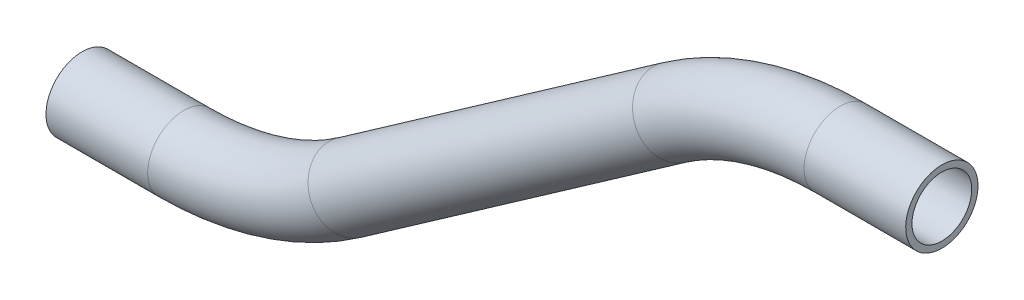
ISO-10303-21;
HEADER;
FILE_DESCRIPTION(('STEP AP214'),'2;1');
FILE_NAME('part.step','',(''),(''),'','','');
FILE_SCHEMA(('AUTOMOTIVE_DESIGN { 1 0 10303 214 1 1 1 1 }'));
ENDSEC;
DATA;
#1=APPLICATION_CONTEXT('core data for automotive mechanical design processes');
#2=APPLICATION_PROTOCOL_DEFINITION('international standard','automotive_design',2000,#1);
#3=PRODUCT_CONTEXT('',#1,'mechanical');
#4=PRODUCT('Part','Part','',(#3));
#5=PRODUCT_RELATED_PRODUCT_CATEGORY('part','',(#4));
#6=PRODUCT_DEFINITION_FORMATION('','',#4);
#7=PRODUCT_DEFINITION_CONTEXT('part definition',#1,'design');
#8=PRODUCT_DEFINITION('design','',#6,#7);
#9=PRODUCT_DEFINITION_SHAPE('','',#8);
#10=(LENGTH_UNIT() NAMED_UNIT(*) SI_UNIT(.MILLI.,.METRE.));
#11=(NAMED_UNIT(*) PLANE_ANGLE_UNIT() SI_UNIT($,.RADIAN.));
#12=(NAMED_UNIT(*) SI_UNIT($,.STERADIAN.) SOLID_ANGLE_UNIT());
#13=UNCERTAINTY_MEASURE_WITH_UNIT(LENGTH_MEASURE(1.E-05),#10,'distance_accuracy_value','');
#14=(GEOMETRIC_REPRESENTATION_CONTEXT(3) GLOBAL_UNCERTAINTY_ASSIGNED_CONTEXT((#13)) GLOBAL_UNIT_ASSIGNED_CONTEXT((#10,
#11,#12)) REPRESENTATION_CONTEXT('',''));
#15=CARTESIAN_POINT('',(0.,0.,0.));
#16=DIRECTION('',(0.,0.,1.));
#17=DIRECTION('',(1.,0.,0.));
#18=AXIS2_PLACEMENT_3D('',#15,#16,#17);
#19=CARTESIAN_POINT('',(121.865926636058,47.4325265861424,0.));
#20=DIRECTION('',(-1.,0.,0.));
#21=DIRECTION('',(0.,-1.,0.));
#22=AXIS2_PLACEMENT_3D('',#19,#20,#21);
#23=CYLINDRICAL_SURFACE('',#22,9.525);
#24=CARTESIAN_POINT('',(95.0916943486364,47.4325265861424,0.));
#25=DIRECTION('',(-1.,0.,0.));
#26=DIRECTION('',(0.,-1.,0.));
#27=AXIS2_PLACEMENT_3D('',#24,#25,#26);
#28=CIRCLE('',#27,9.525);
#29=CARTESIAN_POINT('',(95.0916943486364,56.9575265861425,0.));
#30=VERTEX_POINT('',#29);
#31=EDGE_CURVE('E65',#30,#30,#28,.T.);
#32=ORIENTED_EDGE('',*,*,#31,.F.);
#33=EDGE_LOOP('',(#32));
#34=FACE_BOUND('',#33,.T.);
#35=CARTESIAN_POINT('',(121.865926636058,47.4325265861424,0.));
#36=DIRECTION('',(-1.,0.,0.));
#37=DIRECTION('',(0.,-1.,0.));
#38=AXIS2_PLACEMENT_3D('',#35,#36,#37);
#39=CIRCLE('',#38,9.525);
#40=CARTESIAN_POINT('',(121.865926636058,37.9075265861424,0.));
#41=VERTEX_POINT('',#40);
#42=EDGE_CURVE('E61',#41,#41,#39,.T.);
#43=ORIENTED_EDGE('',*,*,#42,.T.);
#44=EDGE_LOOP('',(#43));
#45=FACE_BOUND('',#44,.T.);
#46=ADVANCED_FACE('F37',(#34,#45),#23,.T.);
#47=CARTESIAN_POINT('',(95.0916943486364,-28.7674734138575,0.));
#48=DIRECTION('',(0.,0.,1.));
#49=DIRECTION('',(1.,0.,0.));
#50=AXIS2_PLACEMENT_3D('',#47,#48,#49);
#51=TOROIDAL_SURFACE('',#50,76.2,9.525);
#52=CARTESIAN_POINT('',(51.3851698986866,33.6519123609635,0.));
#53=DIRECTION('',(-0.819152044288991,-0.573576436351047,0.));
#54=DIRECTION('',(0.573576436351047,-0.819152044288991,0.));
#55=AXIS2_PLACEMENT_3D('',#52,#53,#54);
#56=CIRCLE('',#55,9.525);
#57=CARTESIAN_POINT('',(45.9218543424428,41.4543355828162,0.));
#58=VERTEX_POINT('',#57);
#59=EDGE_CURVE('E69',#58,#58,#56,.T.);
#60=CARTESIAN_POINT('',(95.0916943486364,-28.7674734138575,0.));
#61=DIRECTION('',(0.,0.,1.));
#62=DIRECTION('',(1.,0.,0.));
#63=AXIS2_PLACEMENT_3D('',#60,#61,#62);
#64=CIRCLE('',#63,85.725);
#65=EDGE_CURVE('',#30,#58,#64,.T.);
#66=ORIENTED_EDGE('',*,*,#31,.T.);
#67=ORIENTED_EDGE('',*,*,#59,.F.);
#68=ORIENTED_EDGE('',*,*,#65,.T.);
#69=ORIENTED_EDGE('',*,*,#65,.F.);
#70=EDGE_LOOP('',(#66,#68,#67,#69));
#71=FACE_BOUND('',#70,.T.);
#72=ADVANCED_FACE('F91',(#71),#51,.T.);
#73=CARTESIAN_POINT('',(51.3851698986866,33.6519123609635,0.));
#74=DIRECTION('',(-0.819152044288991,-0.573576436351048,0.));
#75=DIRECTION('',(0.573576436351048,-0.819152044288991,0.));
#76=AXIS2_PLACEMENT_3D('',#73,#74,#75);
#77=CYLINDRICAL_SURFACE('',#76,9.525);
#78=CARTESIAN_POINT('',(-34.0920881762132,-26.1999080885784,0.));
#79=DIRECTION('',(-0.819152044288991,-0.573576436351047,0.));
#80=DIRECTION('',(0.573576436351047,-0.819152044288991,0.));
#81=AXIS2_PLACEMENT_3D('',#78,#79,#80);
#82=CIRCLE('',#81,9.525);
#83=CARTESIAN_POINT('',(-28.6287726199695,-34.002331310431,0.));
#84=VERTEX_POINT('',#83);
#85=EDGE_CURVE('E72',#84,#84,#82,.T.);
#86=ORIENTED_EDGE('',*,*,#85,.F.);
#87=EDGE_LOOP('',(#86));
#88=FACE_BOUND('',#87,.T.);
#89=ORIENTED_EDGE('',*,*,#59,.T.);
#90=EDGE_LOOP('',(#89));
#91=FACE_BOUND('',#90,.T.);
#92=ADVANCED_FACE('F84',(#88,#91),#77,.T.);
#93=CARTESIAN_POINT('',(-77.7986126261631,36.2194776862428,0.));
#94=DIRECTION('',(0.,0.,-1.));
#95=DIRECTION('',(-1.,0.,0.));
#96=AXIS2_PLACEMENT_3D('',#93,#94,#95);
#97=TOROIDAL_SURFACE('',#96,76.2,9.525);
#98=CARTESIAN_POINT('',(-77.7986126261629,-39.9805223137574,0.));
#99=DIRECTION('',(-1.,0.,0.));
#100=DIRECTION('',(0.,-1.,0.));
#101=AXIS2_PLACEMENT_3D('',#98,#99,#100);
#102=CIRCLE('',#101,9.525);
#103=CARTESIAN_POINT('',(-77.7986126261629,-49.5055223137572,0.));
#104=VERTEX_POINT('',#103);
#105=EDGE_CURVE('E41',#104,#104,#102,.T.);
#106=CARTESIAN_POINT('',(-77.7986126261631,36.2194776862428,0.));
#107=DIRECTION('',(0.,0.,-1.));
#108=DIRECTION('',(-1.,0.,0.));
#109=AXIS2_PLACEMENT_3D('',#106,#107,#108);
#110=CIRCLE('',#109,85.725);
#111=EDGE_CURVE('',#84,#104,#110,.T.);
#112=ORIENTED_EDGE('',*,*,#85,.T.);
#113=ORIENTED_EDGE('',*,*,#105,.F.);
#114=ORIENTED_EDGE('',*,*,#111,.T.);
#115=ORIENTED_EDGE('',*,*,#111,.F.);
#116=EDGE_LOOP('',(#112,#114,#113,#115));
#117=FACE_BOUND('',#116,.T.);
#118=ADVANCED_FACE('F82',(#117),#97,.T.);
#119=CARTESIAN_POINT('',(-77.7986126261629,-39.9805223137574,0.));
#120=DIRECTION('',(-1.,0.,0.));
#121=DIRECTION('',(0.,-1.,0.));
#122=AXIS2_PLACEMENT_3D('',#119,#120,#121);
#123=CYLINDRICAL_SURFACE('',#122,9.525);
#124=CARTESIAN_POINT('',(-104.572844913584,-39.9805223137574,0.));
#125=DIRECTION('',(-1.,0.,0.));
#126=DIRECTION('',(0.,-1.,0.));
#127=AXIS2_PLACEMENT_3D('',#124,#125,#126);
#128=CIRCLE('',#127,9.525);
#129=CARTESIAN_POINT('',(-104.572844913584,-49.5055223137574,0.));
#130=VERTEX_POINT('',#129);
#131=EDGE_CURVE('E56',#130,#130,#128,.T.);
#132=ORIENTED_EDGE('',*,*,#131,.F.);
#133=EDGE_LOOP('',(#132));
#134=FACE_BOUND('',#133,.T.);
#135=ORIENTED_EDGE('',*,*,#105,.T.);
#136=EDGE_LOOP('',(#135));
#137=FACE_BOUND('',#136,.T.);
#138=ADVANCED_FACE('F39',(#134,#137),#123,.T.);
#139=CARTESIAN_POINT('',(121.865926636058,47.4325265861424,0.));
#140=DIRECTION('',(-1.,0.,0.));
#141=DIRECTION('',(0.,-1.,0.));
#142=AXIS2_PLACEMENT_3D('',#139,#140,#141);
#143=PLANE('',#142);
#144=CARTESIAN_POINT('',(121.865926636058,47.4325265861424,0.));
#145=DIRECTION('',(-1.,0.,0.));
#146=DIRECTION('',(0.,-1.,0.));
#147=AXIS2_PLACEMENT_3D('',#144,#145,#146);
#148=CIRCLE('',#147,7.874);
#149=CARTESIAN_POINT('',(121.865926636058,39.5585265861424,0.));
#150=VERTEX_POINT('',#149);
#151=EDGE_CURVE('E60',#150,#150,#148,.F.);
#152=ORIENTED_EDGE('',*,*,#151,.F.);
#153=EDGE_LOOP('',(#152));
#154=FACE_BOUND('',#153,.T.);
#155=ORIENTED_EDGE('',*,*,#42,.F.);
#156=EDGE_LOOP('',(#155));
#157=FACE_BOUND('',#156,.T.);
#158=ADVANCED_FACE('F89',(#154,#157),#143,.F.);
#159=CARTESIAN_POINT('',(-104.572844913584,-39.9805223137574,0.));
#160=DIRECTION('',(-1.,0.,0.));
#161=DIRECTION('',(0.,-1.,0.));
#162=AXIS2_PLACEMENT_3D('',#159,#160,#161);
#163=PLANE('',#162);
#164=CARTESIAN_POINT('',(-104.572844913584,-39.9805223137574,0.));
#165=DIRECTION('',(-1.,0.,0.));
#166=DIRECTION('',(0.,-1.,0.));
#167=AXIS2_PLACEMENT_3D('',#164,#165,#166);
#168=CIRCLE('',#167,7.874);
#169=CARTESIAN_POINT('',(-104.572844913584,-47.8545223137574,0.));
#170=VERTEX_POINT('',#169);
#171=EDGE_CURVE('E10',#170,#170,#168,.F.);
#172=ORIENTED_EDGE('',*,*,#171,.T.);
#173=EDGE_LOOP('',(#172));
#174=FACE_BOUND('',#173,.T.);
#175=ORIENTED_EDGE('',*,*,#131,.T.);
#176=EDGE_LOOP('',(#175));
#177=FACE_BOUND('',#176,.T.);
#178=ADVANCED_FACE('F108',(#174,#177),#163,.T.);
#179=CARTESIAN_POINT('',(121.865926636058,47.4325265861424,0.));
#180=DIRECTION('',(-1.,0.,0.));
#181=DIRECTION('',(0.,-1.,0.));
#182=AXIS2_PLACEMENT_3D('',#179,#180,#181);
#183=CYLINDRICAL_SURFACE('',#182,7.874);
#184=CARTESIAN_POINT('',(95.0916943486364,47.4325265861424,0.));
#185=DIRECTION('',(-1.,0.,0.));
#186=DIRECTION('',(0.,-1.,0.));
#187=AXIS2_PLACEMENT_3D('',#184,#185,#186);
#188=CIRCLE('',#187,7.874);
#189=CARTESIAN_POINT('',(95.0916943486364,55.3065265861425,0.));
#190=VERTEX_POINT('',#189);
#191=EDGE_CURVE('E205',#190,#190,#188,.F.);
#192=ORIENTED_EDGE('',*,*,#191,.F.);
#193=EDGE_LOOP('',(#192));
#194=FACE_BOUND('',#193,.T.);
#195=ORIENTED_EDGE('',*,*,#151,.T.);
#196=EDGE_LOOP('',(#195));
#197=FACE_BOUND('',#196,.T.);
#198=ADVANCED_FACE('F111',(#194,#197),#183,.F.);
#199=CARTESIAN_POINT('',(95.0916943486364,-28.7674734138575,0.));
#200=DIRECTION('',(0.,0.,1.));
#201=DIRECTION('',(1.,0.,0.));
#202=AXIS2_PLACEMENT_3D('',#199,#200,#201);
#203=TOROIDAL_SURFACE('',#202,76.2,7.874);
#204=CARTESIAN_POINT('',(51.3851698986866,33.6519123609635,0.));
#205=DIRECTION('',(-0.819152044288991,-0.573576436351047,0.));
#206=DIRECTION('',(0.573576436351047,-0.819152044288991,0.));
#207=AXIS2_PLACEMENT_3D('',#204,#205,#206);
#208=CIRCLE('',#207,7.874);
#209=CARTESIAN_POINT('',(46.8688290388584,40.1019155576951,0.));
#210=VERTEX_POINT('',#209);
#211=EDGE_CURVE('E203',#210,#210,#208,.F.);
#212=CARTESIAN_POINT('',(95.0916943486364,-28.7674734138575,0.));
#213=DIRECTION('',(0.,0.,1.));
#214=DIRECTION('',(1.,0.,0.));
#215=AXIS2_PLACEMENT_3D('',#212,#213,#214);
#216=CIRCLE('',#215,84.074);
#217=EDGE_CURVE('',#190,#210,#216,.T.);
#218=ORIENTED_EDGE('',*,*,#191,.T.);
#219=ORIENTED_EDGE('',*,*,#211,.F.);
#220=ORIENTED_EDGE('',*,*,#217,.T.);
#221=ORIENTED_EDGE('',*,*,#217,.F.);
#222=EDGE_LOOP('',(#218,#220,#219,#221));
#223=FACE_BOUND('',#222,.T.);
#224=ADVANCED_FACE('F166',(#223),#203,.F.);
#225=CARTESIAN_POINT('',(51.3851698986866,33.6519123609635,0.));
#226=DIRECTION('',(-0.819152044288991,-0.573576436351048,0.));
#227=DIRECTION('',(0.573576436351048,-0.819152044288991,0.));
#228=AXIS2_PLACEMENT_3D('',#225,#226,#227);
#229=CYLINDRICAL_SURFACE('',#228,7.874);
#230=CARTESIAN_POINT('',(-34.0920881762132,-26.1999080885784,0.));
#231=DIRECTION('',(-0.819152044288991,-0.573576436351047,0.));
#232=DIRECTION('',(0.573576436351047,-0.819152044288991,0.));
#233=AXIS2_PLACEMENT_3D('',#230,#231,#232);
#234=CIRCLE('',#233,7.874);
#235=CARTESIAN_POINT('',(-29.5757473163851,-32.6499112853098,0.));
#236=VERTEX_POINT('',#235);
#237=EDGE_CURVE('E52',#236,#236,#234,.F.);
#238=ORIENTED_EDGE('',*,*,#237,.F.);
#239=EDGE_LOOP('',(#238));
#240=FACE_BOUND('',#239,.T.);
#241=ORIENTED_EDGE('',*,*,#211,.T.);
#242=EDGE_LOOP('',(#241));
#243=FACE_BOUND('',#242,.T.);
#244=ADVANCED_FACE('F102',(#240,#243),#229,.F.);
#245=CARTESIAN_POINT('',(-77.7986126261631,36.2194776862428,0.));
#246=DIRECTION('',(0.,0.,-1.));
#247=DIRECTION('',(-1.,0.,0.));
#248=AXIS2_PLACEMENT_3D('',#245,#246,#247);
#249=TOROIDAL_SURFACE('',#248,76.2,7.874);
#250=CARTESIAN_POINT('',(-77.7986126261629,-39.9805223137574,0.));
#251=DIRECTION('',(-1.,0.,0.));
#252=DIRECTION('',(0.,-1.,0.));
#253=AXIS2_PLACEMENT_3D('',#250,#251,#252);
#254=CIRCLE('',#253,7.874);
#255=CARTESIAN_POINT('',(-77.7986126261629,-47.8545223137572,0.));
#256=VERTEX_POINT('',#255);
#257=EDGE_CURVE('E46',#256,#256,#254,.F.);
#258=CARTESIAN_POINT('',(-77.7986126261631,36.2194776862428,0.));
#259=DIRECTION('',(0.,0.,-1.));
#260=DIRECTION('',(-1.,0.,0.));
#261=AXIS2_PLACEMENT_3D('',#258,#259,#260);
#262=CIRCLE('',#261,84.074);
#263=EDGE_CURVE('',#236,#256,#262,.T.);
#264=ORIENTED_EDGE('',*,*,#237,.T.);
#265=ORIENTED_EDGE('',*,*,#257,.F.);
#266=ORIENTED_EDGE('',*,*,#263,.T.);
#267=ORIENTED_EDGE('',*,*,#263,.F.);
#268=EDGE_LOOP('',(#264,#266,#265,#267));
#269=FACE_BOUND('',#268,.T.);
#270=ADVANCED_FACE('F96',(#269),#249,.F.);
#271=CARTESIAN_POINT('',(-77.7986126261629,-39.9805223137574,0.));
#272=DIRECTION('',(-1.,0.,0.));
#273=DIRECTION('',(0.,-1.,0.));
#274=AXIS2_PLACEMENT_3D('',#271,#272,#273);
#275=CYLINDRICAL_SURFACE('',#274,7.874);
#276=ORIENTED_EDGE('',*,*,#171,.F.);
#277=EDGE_LOOP('',(#276));
#278=FACE_BOUND('',#277,.T.);
#279=ORIENTED_EDGE('',*,*,#257,.T.);
#280=EDGE_LOOP('',(#279));
#281=FACE_BOUND('',#280,.T.);
#282=ADVANCED_FACE('F94',(#278,#281),#275,.F.);
#283=CLOSED_SHELL('',(#46,#72,#92,#118,#138,#158,#178,#198,#224,#244,#270,#282));
#284=MANIFOLD_SOLID_BREP('B2',#283);
#285=ADVANCED_BREP_SHAPE_REPRESENTATION('',(#18,#284),#14);
#286=SHAPE_DEFINITION_REPRESENTATION(#9,#285);
ENDSEC;
END-ISO-10303-21;
